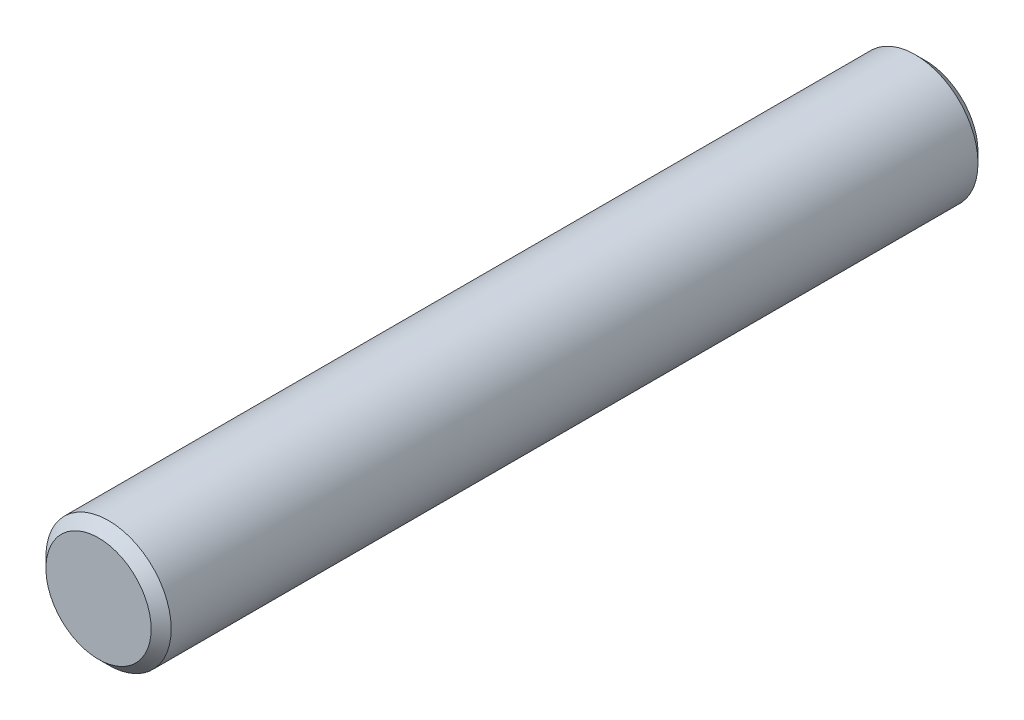
ISO-10303-21;
HEADER;
FILE_DESCRIPTION(('STEP AP214'),'2;1');
FILE_NAME('part.step','',(''),(''),'','','');
FILE_SCHEMA(('AUTOMOTIVE_DESIGN { 1 0 10303 214 1 1 1 1 }'));
ENDSEC;
DATA;
#1=APPLICATION_CONTEXT('core data for automotive mechanical design processes');
#2=APPLICATION_PROTOCOL_DEFINITION('international standard','automotive_design',2000,#1);
#3=PRODUCT_CONTEXT('',#1,'mechanical');
#4=PRODUCT('Part','Part','',(#3));
#5=PRODUCT_RELATED_PRODUCT_CATEGORY('part','',(#4));
#6=PRODUCT_DEFINITION_FORMATION('','',#4);
#7=PRODUCT_DEFINITION_CONTEXT('part definition',#1,'design');
#8=PRODUCT_DEFINITION('design','',#6,#7);
#9=PRODUCT_DEFINITION_SHAPE('','',#8);
#10=(LENGTH_UNIT() NAMED_UNIT(*) SI_UNIT(.MILLI.,.METRE.));
#11=(NAMED_UNIT(*) PLANE_ANGLE_UNIT() SI_UNIT($,.RADIAN.));
#12=(NAMED_UNIT(*) SI_UNIT($,.STERADIAN.) SOLID_ANGLE_UNIT());
#13=UNCERTAINTY_MEASURE_WITH_UNIT(LENGTH_MEASURE(1.E-05),#10,'distance_accuracy_value','');
#14=(GEOMETRIC_REPRESENTATION_CONTEXT(3) GLOBAL_UNCERTAINTY_ASSIGNED_CONTEXT((#13)) GLOBAL_UNIT_ASSIGNED_CONTEXT((#10,
#11,#12)) REPRESENTATION_CONTEXT('',''));
#15=CARTESIAN_POINT('',(0.,0.,0.));
#16=DIRECTION('',(0.,0.,1.));
#17=DIRECTION('',(1.,0.,0.));
#18=AXIS2_PLACEMENT_3D('',#15,#16,#17);
#19=CARTESIAN_POINT('',(0.,0.,33.));
#20=DIRECTION('',(0.,0.,-1.));
#21=DIRECTION('',(-1.,0.,0.));
#22=AXIS2_PLACEMENT_3D('',#19,#20,#21);
#23=CYLINDRICAL_SURFACE('',#22,2.5);
#24=CARTESIAN_POINT('',(0.,0.,0.399999999999998));
#25=DIRECTION('',(0.,0.,1.));
#26=DIRECTION('',(1.,0.,0.));
#27=AXIS2_PLACEMENT_3D('',#24,#25,#26);
#28=CIRCLE('',#27,2.5);
#29=CARTESIAN_POINT('',(2.5,0.,0.399999999999998));
#30=VERTEX_POINT('',#29);
#31=EDGE_CURVE('E53',#30,#30,#28,.T.);
#32=ORIENTED_EDGE('',*,*,#31,.T.);
#33=EDGE_LOOP('',(#32));
#34=FACE_BOUND('',#33,.T.);
#35=CARTESIAN_POINT('',(0.,0.,32.6));
#36=DIRECTION('',(0.,0.,1.));
#37=DIRECTION('',(1.,0.,0.));
#38=AXIS2_PLACEMENT_3D('',#35,#36,#37);
#39=CIRCLE('',#38,2.5);
#40=CARTESIAN_POINT('',(2.5,0.,32.6));
#41=VERTEX_POINT('',#40);
#42=EDGE_CURVE('E58',#41,#41,#39,.F.);
#43=ORIENTED_EDGE('',*,*,#42,.T.);
#44=EDGE_LOOP('',(#43));
#45=FACE_BOUND('',#44,.T.);
#46=ADVANCED_FACE('F39',(#34,#45),#23,.T.);
#47=CARTESIAN_POINT('',(0.,0.,33.));
#48=DIRECTION('',(0.,0.,1.));
#49=DIRECTION('',(1.,0.,0.));
#50=AXIS2_PLACEMENT_3D('',#47,#48,#49);
#51=PLANE('',#50);
#52=CARTESIAN_POINT('',(0.,0.,33.));
#53=DIRECTION('',(0.,0.,1.));
#54=DIRECTION('',(1.,0.,0.));
#55=AXIS2_PLACEMENT_3D('',#52,#53,#54);
#56=CIRCLE('',#55,2.10000000000001);
#57=CARTESIAN_POINT('',(2.10000000000001,0.,33.));
#58=VERTEX_POINT('',#57);
#59=EDGE_CURVE('E10',#58,#58,#56,.T.);
#60=ORIENTED_EDGE('',*,*,#59,.T.);
#61=EDGE_LOOP('',(#60));
#62=FACE_BOUND('',#61,.T.);
#63=ADVANCED_FACE('F75',(#62),#51,.T.);
#64=CARTESIAN_POINT('',(0.,0.,0.));
#65=DIRECTION('',(0.,0.,1.));
#66=DIRECTION('',(1.,0.,0.));
#67=AXIS2_PLACEMENT_3D('',#64,#65,#66);
#68=PLANE('',#67);
#69=CARTESIAN_POINT('',(0.,0.,0.));
#70=DIRECTION('',(0.,0.,1.));
#71=DIRECTION('',(1.,0.,0.));
#72=AXIS2_PLACEMENT_3D('',#69,#70,#71);
#73=CIRCLE('',#72,2.1);
#74=CARTESIAN_POINT('',(2.1,0.,0.));
#75=VERTEX_POINT('',#74);
#76=EDGE_CURVE('E48',#75,#75,#73,.F.);
#77=ORIENTED_EDGE('',*,*,#76,.T.);
#78=EDGE_LOOP('',(#77));
#79=FACE_BOUND('',#78,.T.);
#80=ADVANCED_FACE('F72',(#79),#68,.F.);
#81=CARTESIAN_POINT('',(0.,0.,0.399999999999998));
#82=DIRECTION('',(0.,0.,1.));
#83=DIRECTION('',(1.,0.,0.));
#84=AXIS2_PLACEMENT_3D('',#81,#82,#83);
#85=CONICAL_SURFACE('',#84,2.5,0.785398163397446);
#86=ORIENTED_EDGE('',*,*,#76,.F.);
#87=EDGE_LOOP('',(#86));
#88=FACE_BOUND('',#87,.T.);
#89=ORIENTED_EDGE('',*,*,#31,.F.);
#90=EDGE_LOOP('',(#89));
#91=FACE_BOUND('',#90,.T.);
#92=ADVANCED_FACE('F68',(#88,#91),#85,.T.);
#93=CARTESIAN_POINT('',(0.,0.,33.));
#94=DIRECTION('',(0.,0.,-1.));
#95=DIRECTION('',(-1.,0.,0.));
#96=AXIS2_PLACEMENT_3D('',#93,#94,#95);
#97=CONICAL_SURFACE('',#96,2.10000000000001,0.785398163397442);
#98=ORIENTED_EDGE('',*,*,#42,.F.);
#99=EDGE_LOOP('',(#98));
#100=FACE_BOUND('',#99,.T.);
#101=ORIENTED_EDGE('',*,*,#59,.F.);
#102=EDGE_LOOP('',(#101));
#103=FACE_BOUND('',#102,.T.);
#104=ADVANCED_FACE('F42',(#100,#103),#97,.T.);
#105=CLOSED_SHELL('',(#46,#63,#80,#92,#104));
#106=MANIFOLD_SOLID_BREP('B2',#105);
#107=ADVANCED_BREP_SHAPE_REPRESENTATION('',(#18,#106),#14);
#108=SHAPE_DEFINITION_REPRESENTATION(#9,#107);
ENDSEC;
END-ISO-10303-21;
